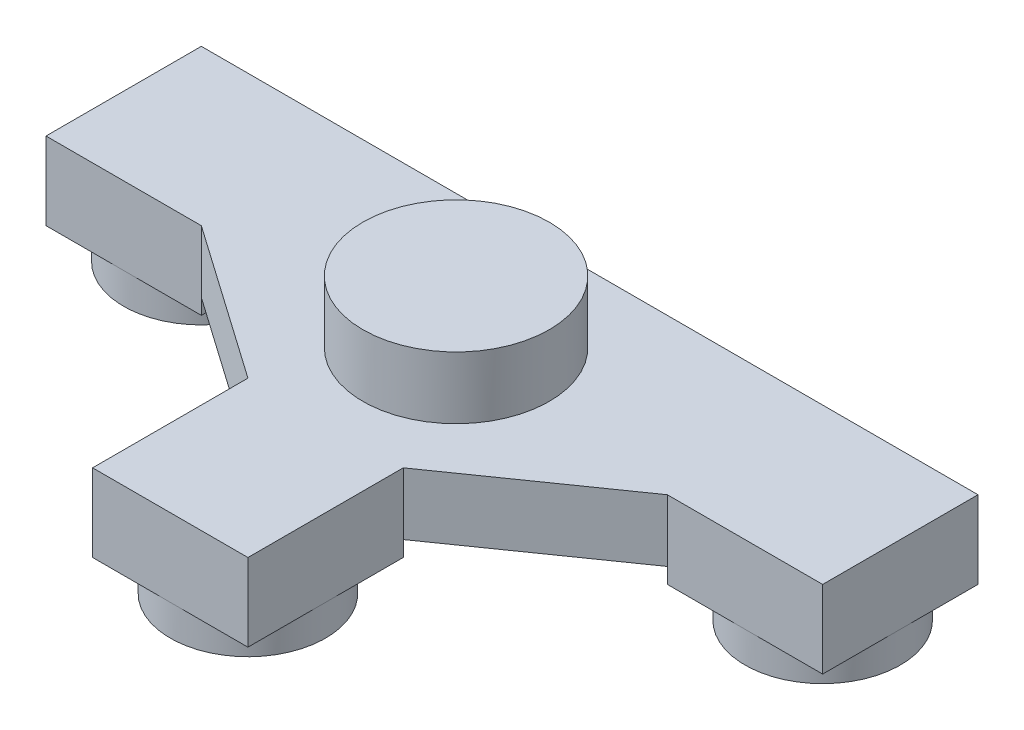
ISO-10303-21;
HEADER;
FILE_DESCRIPTION(('STEP AP214'),'2;1');
FILE_NAME('part.step','',(''),(''),'','','');
FILE_SCHEMA(('AUTOMOTIVE_DESIGN { 1 0 10303 214 1 1 1 1 }'));
ENDSEC;
DATA;
#1=APPLICATION_CONTEXT('core data for automotive mechanical design processes');
#2=APPLICATION_PROTOCOL_DEFINITION('international standard','automotive_design',2000,#1);
#3=PRODUCT_CONTEXT('',#1,'mechanical');
#4=PRODUCT('Part','Part','',(#3));
#5=PRODUCT_RELATED_PRODUCT_CATEGORY('part','',(#4));
#6=PRODUCT_DEFINITION_FORMATION('','',#4);
#7=PRODUCT_DEFINITION_CONTEXT('part definition',#1,'design');
#8=PRODUCT_DEFINITION('design','',#6,#7);
#9=PRODUCT_DEFINITION_SHAPE('','',#8);
#10=(LENGTH_UNIT() NAMED_UNIT(*) SI_UNIT(.MILLI.,.METRE.));
#11=(NAMED_UNIT(*) PLANE_ANGLE_UNIT() SI_UNIT($,.RADIAN.));
#12=(NAMED_UNIT(*) SI_UNIT($,.STERADIAN.) SOLID_ANGLE_UNIT());
#13=UNCERTAINTY_MEASURE_WITH_UNIT(LENGTH_MEASURE(1.E-05),#10,'distance_accuracy_value','');
#14=(GEOMETRIC_REPRESENTATION_CONTEXT(3) GLOBAL_UNCERTAINTY_ASSIGNED_CONTEXT((#13)) GLOBAL_UNIT_ASSIGNED_CONTEXT((#10,
#11,#12)) REPRESENTATION_CONTEXT('',''));
#15=CARTESIAN_POINT('',(0.,0.,0.));
#16=DIRECTION('',(0.,0.,1.));
#17=DIRECTION('',(1.,0.,0.));
#18=AXIS2_PLACEMENT_3D('',#15,#16,#17);
#19=CARTESIAN_POINT('',(0.,-1.,0.));
#20=DIRECTION('',(0.,1.,0.));
#21=DIRECTION('',(0.,0.,1.));
#22=AXIS2_PLACEMENT_3D('',#19,#20,#21);
#23=PLANE('',#22);
#24=CARTESIAN_POINT('',(-20.,-1.,0.));
#25=DIRECTION('',(0.,1.,0.));
#26=DIRECTION('',(0.,0.,1.));
#27=AXIS2_PLACEMENT_3D('',#24,#25,#26);
#28=CIRCLE('',#27,5.);
#29=CARTESIAN_POINT('',(-20.,-1.,5.));
#30=VERTEX_POINT('',#29);
#31=CARTESIAN_POINT('',(-25.,-1.,0.));
#32=VERTEX_POINT('',#31);
#33=EDGE_CURVE('E11',#30,#32,#28,.F.);
#34=ORIENTED_EDGE('',*,*,#33,.F.);
#35=DIRECTION('',(1.,0.,0.));
#36=VECTOR('',#35,1.);
#37=CARTESIAN_POINT('',(-25.,-1.,5.));
#38=LINE('',#37,#36);
#39=CARTESIAN_POINT('',(-25.,-1.,5.));
#40=VERTEX_POINT('',#39);
#41=EDGE_CURVE('E180',#40,#30,#38,.T.);
#42=ORIENTED_EDGE('',*,*,#41,.F.);
#43=DIRECTION('',(0.,0.,1.));
#44=VECTOR('',#43,1.);
#45=CARTESIAN_POINT('',(-25.,-1.,-5.));
#46=LINE('',#45,#44);
#47=EDGE_CURVE('E197',#32,#40,#46,.T.);
#48=ORIENTED_EDGE('',*,*,#47,.F.);
#49=EDGE_LOOP('',(#34,#42,#48));
#50=FACE_BOUND('',#49,.T.);
#51=ADVANCED_FACE('F39',(#50),#23,.F.);
#52=CARTESIAN_POINT('',(-20.,-1.,-5.));
#53=VERTEX_POINT('',#52);
#54=EDGE_CURVE('E49',#32,#53,#28,.F.);
#55=ORIENTED_EDGE('',*,*,#54,.F.);
#56=CARTESIAN_POINT('',(-25.,-1.,-5.));
#57=VERTEX_POINT('',#56);
#58=EDGE_CURVE('E196',#57,#32,#46,.T.);
#59=ORIENTED_EDGE('',*,*,#58,.F.);
#60=DIRECTION('',(-1.,0.,0.));
#61=VECTOR('',#60,1.);
#62=CARTESIAN_POINT('',(-25.,-1.,-5.));
#63=LINE('',#62,#61);
#64=EDGE_CURVE('E345',#53,#57,#63,.T.);
#65=ORIENTED_EDGE('',*,*,#64,.F.);
#66=EDGE_LOOP('',(#55,#59,#65));
#67=FACE_BOUND('',#66,.T.);
#68=ADVANCED_FACE('F430',(#67),#23,.F.);
#69=CARTESIAN_POINT('',(-20.,-1.,0.));
#70=DIRECTION('',(0.,-1.,0.));
#71=DIRECTION('',(0.,0.,-1.));
#72=AXIS2_PLACEMENT_3D('',#69,#70,#71);
#73=CIRCLE('',#72,5.);
#74=CARTESIAN_POINT('',(-15.,-1.,0.));
#75=VERTEX_POINT('',#74);
#76=EDGE_CURVE('E62',#53,#75,#73,.T.);
#77=ORIENTED_EDGE('',*,*,#76,.F.);
#78=CARTESIAN_POINT('',(-15.,-1.,-5.));
#79=VERTEX_POINT('',#78);
#80=EDGE_CURVE('E333',#79,#53,#63,.T.);
#81=ORIENTED_EDGE('',*,*,#80,.F.);
#82=DIRECTION('',(0.,0.,-1.));
#83=VECTOR('',#82,1.);
#84=CARTESIAN_POINT('',(-15.,-1.,-5.));
#85=LINE('',#84,#83);
#86=EDGE_CURVE('E190',#75,#79,#85,.T.);
#87=ORIENTED_EDGE('',*,*,#86,.F.);
#88=EDGE_LOOP('',(#77,#81,#87));
#89=FACE_BOUND('',#88,.T.);
#90=ADVANCED_FACE('F435',(#89),#23,.F.);
#91=CARTESIAN_POINT('',(0.,-1.,0.));
#92=DIRECTION('',(0.,1.,0.));
#93=DIRECTION('',(0.,0.,1.));
#94=AXIS2_PLACEMENT_3D('',#91,#92,#93);
#95=PLANE('',#94);
#96=CARTESIAN_POINT('',(20.,-1.,0.));
#97=DIRECTION('',(0.,1.,0.));
#98=DIRECTION('',(0.,0.,1.));
#99=AXIS2_PLACEMENT_3D('',#96,#97,#98);
#100=CIRCLE('',#99,5.);
#101=CARTESIAN_POINT('',(20.,-1.,5.));
#102=VERTEX_POINT('',#101);
#103=CARTESIAN_POINT('',(15.,-1.,0.));
#104=VERTEX_POINT('',#103);
#105=EDGE_CURVE('E203',#102,#104,#100,.F.);
#106=ORIENTED_EDGE('',*,*,#105,.F.);
#107=DIRECTION('',(1.,0.,0.));
#108=VECTOR('',#107,1.);
#109=CARTESIAN_POINT('',(15.,-1.,5.));
#110=LINE('',#109,#108);
#111=CARTESIAN_POINT('',(15.,-1.,5.));
#112=VERTEX_POINT('',#111);
#113=EDGE_CURVE('E372',#112,#102,#110,.T.);
#114=ORIENTED_EDGE('',*,*,#113,.F.);
#115=DIRECTION('',(0.,0.,1.));
#116=VECTOR('',#115,1.);
#117=CARTESIAN_POINT('',(15.,-1.,-5.));
#118=LINE('',#117,#116);
#119=EDGE_CURVE('E361',#104,#112,#118,.T.);
#120=ORIENTED_EDGE('',*,*,#119,.F.);
#121=EDGE_LOOP('',(#106,#114,#120));
#122=FACE_BOUND('',#121,.T.);
#123=ADVANCED_FACE('F451',(#122),#95,.F.);
#124=CARTESIAN_POINT('',(20.,-1.,-5.));
#125=VERTEX_POINT('',#124);
#126=EDGE_CURVE('E207',#104,#125,#100,.F.);
#127=ORIENTED_EDGE('',*,*,#126,.F.);
#128=CARTESIAN_POINT('',(15.,-1.,-5.));
#129=VERTEX_POINT('',#128);
#130=EDGE_CURVE('E376',#129,#104,#118,.T.);
#131=ORIENTED_EDGE('',*,*,#130,.F.);
#132=DIRECTION('',(-1.,0.,0.));
#133=VECTOR('',#132,1.);
#134=CARTESIAN_POINT('',(15.,-1.,-5.));
#135=LINE('',#134,#133);
#136=EDGE_CURVE('E366',#125,#129,#135,.T.);
#137=ORIENTED_EDGE('',*,*,#136,.F.);
#138=EDGE_LOOP('',(#127,#131,#137));
#139=FACE_BOUND('',#138,.T.);
#140=ADVANCED_FACE('F455',(#139),#95,.F.);
#141=CARTESIAN_POINT('',(20.,-1.,0.));
#142=DIRECTION('',(0.,-1.,0.));
#143=DIRECTION('',(0.,0.,-1.));
#144=AXIS2_PLACEMENT_3D('',#141,#142,#143);
#145=CIRCLE('',#144,5.);
#146=CARTESIAN_POINT('',(25.,-1.,0.));
#147=VERTEX_POINT('',#146);
#148=EDGE_CURVE('E240',#125,#147,#145,.T.);
#149=ORIENTED_EDGE('',*,*,#148,.F.);
#150=CARTESIAN_POINT('',(25.,-1.,-5.));
#151=VERTEX_POINT('',#150);
#152=EDGE_CURVE('E353',#151,#125,#135,.T.);
#153=ORIENTED_EDGE('',*,*,#152,.F.);
#154=DIRECTION('',(0.,0.,-1.));
#155=VECTOR('',#154,1.);
#156=CARTESIAN_POINT('',(25.,-1.,-5.));
#157=LINE('',#156,#155);
#158=EDGE_CURVE('E371',#147,#151,#157,.T.);
#159=ORIENTED_EDGE('',*,*,#158,.F.);
#160=EDGE_LOOP('',(#149,#153,#159));
#161=FACE_BOUND('',#160,.T.);
#162=ADVANCED_FACE('F461',(#161),#95,.F.);
#163=CARTESIAN_POINT('',(0.,-1.,0.));
#164=DIRECTION('',(0.,1.,0.));
#165=DIRECTION('',(0.,0.,1.));
#166=AXIS2_PLACEMENT_3D('',#163,#164,#165);
#167=PLANE('',#166);
#168=CARTESIAN_POINT('',(0.,-1.,17.));
#169=DIRECTION('',(0.,-1.,0.));
#170=DIRECTION('',(0.,0.,-1.));
#171=AXIS2_PLACEMENT_3D('',#168,#169,#170);
#172=CIRCLE('',#171,5.);
#173=CARTESIAN_POINT('',(0.,-1.,12.));
#174=VERTEX_POINT('',#173);
#175=CARTESIAN_POINT('',(5.,-1.,17.));
#176=VERTEX_POINT('',#175);
#177=EDGE_CURVE('E222',#174,#176,#172,.T.);
#178=ORIENTED_EDGE('',*,*,#177,.F.);
#179=DIRECTION('',(-1.,0.,0.));
#180=VECTOR('',#179,1.);
#181=CARTESIAN_POINT('',(-5.,-1.,12.));
#182=LINE('',#181,#180);
#183=CARTESIAN_POINT('',(5.,-1.,12.));
#184=VERTEX_POINT('',#183);
#185=EDGE_CURVE('E384',#184,#174,#182,.T.);
#186=ORIENTED_EDGE('',*,*,#185,.F.);
#187=DIRECTION('',(0.,0.,-1.));
#188=VECTOR('',#187,1.);
#189=CARTESIAN_POINT('',(5.,-1.,12.));
#190=LINE('',#189,#188);
#191=EDGE_CURVE('E399',#176,#184,#190,.T.);
#192=ORIENTED_EDGE('',*,*,#191,.F.);
#193=EDGE_LOOP('',(#178,#186,#192));
#194=FACE_BOUND('',#193,.T.);
#195=ADVANCED_FACE('F427',(#194),#167,.F.);
#196=CARTESIAN_POINT('',(0.,-1.,22.));
#197=VERTEX_POINT('',#196);
#198=EDGE_CURVE('E216',#176,#197,#172,.T.);
#199=ORIENTED_EDGE('',*,*,#198,.F.);
#200=CARTESIAN_POINT('',(5.,-1.,22.));
#201=VERTEX_POINT('',#200);
#202=EDGE_CURVE('E395',#201,#176,#190,.T.);
#203=ORIENTED_EDGE('',*,*,#202,.F.);
#204=DIRECTION('',(1.,0.,0.));
#205=VECTOR('',#204,1.);
#206=CARTESIAN_POINT('',(-5.,-1.,22.));
#207=LINE('',#206,#205);
#208=EDGE_CURVE('E404',#197,#201,#207,.T.);
#209=ORIENTED_EDGE('',*,*,#208,.F.);
#210=EDGE_LOOP('',(#199,#203,#209));
#211=FACE_BOUND('',#210,.T.);
#212=ADVANCED_FACE('F475',(#211),#167,.F.);
#213=CARTESIAN_POINT('',(-5.,-1.,17.));
#214=VERTEX_POINT('',#213);
#215=EDGE_CURVE('E220',#197,#214,#172,.T.);
#216=ORIENTED_EDGE('',*,*,#215,.F.);
#217=CARTESIAN_POINT('',(-5.,-1.,22.));
#218=VERTEX_POINT('',#217);
#219=EDGE_CURVE('E400',#218,#197,#207,.T.);
#220=ORIENTED_EDGE('',*,*,#219,.F.);
#221=DIRECTION('',(0.,0.,1.));
#222=VECTOR('',#221,1.);
#223=CARTESIAN_POINT('',(-5.,-1.,12.));
#224=LINE('',#223,#222);
#225=EDGE_CURVE('E391',#214,#218,#224,.T.);
#226=ORIENTED_EDGE('',*,*,#225,.F.);
#227=EDGE_LOOP('',(#216,#220,#226));
#228=FACE_BOUND('',#227,.T.);
#229=ADVANCED_FACE('F428',(#228),#167,.F.);
#230=CARTESIAN_POINT('',(0.,0.,0.));
#231=DIRECTION('',(0.,-1.,0.));
#232=DIRECTION('',(0.,0.,-1.));
#233=AXIS2_PLACEMENT_3D('',#230,#231,#232);
#234=PLANE('',#233);
#235=DIRECTION('',(-1.,0.,0.));
#236=VECTOR('',#235,1.);
#237=CARTESIAN_POINT('',(-5.,0.,12.));
#238=LINE('',#237,#236);
#239=CARTESIAN_POINT('',(5.,0.,12.));
#240=VERTEX_POINT('',#239);
#241=CARTESIAN_POINT('',(-5.,0.,12.));
#242=VERTEX_POINT('',#241);
#243=EDGE_CURVE('E387',#240,#242,#238,.T.);
#244=ORIENTED_EDGE('',*,*,#243,.T.);
#245=DIRECTION('',(0.81923192051904,0.,0.573462344363328));
#246=VECTOR('',#245,1.);
#247=CARTESIAN_POINT('',(-15.,0.,5.));
#248=LINE('',#247,#246);
#249=CARTESIAN_POINT('',(-15.,0.,5.));
#250=VERTEX_POINT('',#249);
#251=EDGE_CURVE('E296',#250,#242,#248,.T.);
#252=ORIENTED_EDGE('',*,*,#251,.F.);
#253=DIRECTION('',(0.,0.,-1.));
#254=VECTOR('',#253,1.);
#255=CARTESIAN_POINT('',(-15.,0.,-5.));
#256=LINE('',#255,#254);
#257=CARTESIAN_POINT('',(-15.,0.,-5.));
#258=VERTEX_POINT('',#257);
#259=EDGE_CURVE('E337',#250,#258,#256,.T.);
#260=ORIENTED_EDGE('',*,*,#259,.T.);
#261=DIRECTION('',(-1.,0.,0.));
#262=VECTOR('',#261,1.);
#263=CARTESIAN_POINT('',(25.,0.,-5.));
#264=LINE('',#263,#262);
#265=CARTESIAN_POINT('',(15.,0.,-5.));
#266=VERTEX_POINT('',#265);
#267=EDGE_CURVE('E288',#266,#258,#264,.T.);
#268=ORIENTED_EDGE('',*,*,#267,.F.);
#269=DIRECTION('',(0.,0.,1.));
#270=VECTOR('',#269,1.);
#271=CARTESIAN_POINT('',(15.,0.,-5.));
#272=LINE('',#271,#270);
#273=CARTESIAN_POINT('',(15.,0.,5.));
#274=VERTEX_POINT('',#273);
#275=EDGE_CURVE('E357',#266,#274,#272,.T.);
#276=ORIENTED_EDGE('',*,*,#275,.T.);
#277=DIRECTION('',(0.81923192051904,0.,-0.573462344363329));
#278=VECTOR('',#277,1.);
#279=CARTESIAN_POINT('',(5.,0.,12.));
#280=LINE('',#279,#278);
#281=EDGE_CURVE('E292',#240,#274,#280,.T.);
#282=ORIENTED_EDGE('',*,*,#281,.F.);
#283=EDGE_LOOP('',(#244,#252,#260,#268,#276,#282));
#284=FACE_BOUND('',#283,.T.);
#285=ADVANCED_FACE('F604',(#284),#234,.T.);
#286=CARTESIAN_POINT('',(-25.,4.,5.));
#287=DIRECTION('',(0.,0.,-1.));
#288=DIRECTION('',(-1.,0.,0.));
#289=AXIS2_PLACEMENT_3D('',#286,#287,#288);
#290=PLANE('',#289);
#291=DIRECTION('',(0.,-1.,0.));
#292=VECTOR('',#291,1.);
#293=CARTESIAN_POINT('',(-25.,4.,5.));
#294=LINE('',#293,#292);
#295=CARTESIAN_POINT('',(-25.,4.,5.));
#296=VERTEX_POINT('',#295);
#297=EDGE_CURVE('E185',#296,#40,#294,.T.);
#298=ORIENTED_EDGE('',*,*,#297,.T.);
#299=ORIENTED_EDGE('',*,*,#41,.T.);
#300=CARTESIAN_POINT('',(-15.,-1.,5.));
#301=VERTEX_POINT('',#300);
#302=EDGE_CURVE('E181',#30,#301,#38,.T.);
#303=ORIENTED_EDGE('',*,*,#302,.T.);
#304=DIRECTION('',(0.,1.,0.));
#305=VECTOR('',#304,1.);
#306=CARTESIAN_POINT('',(-15.,-1.,5.));
#307=LINE('',#306,#305);
#308=EDGE_CURVE('E330',#301,#250,#307,.T.);
#309=ORIENTED_EDGE('',*,*,#308,.T.);
#310=DIRECTION('',(0.,-1.,0.));
#311=VECTOR('',#310,1.);
#312=CARTESIAN_POINT('',(-15.,4.,5.));
#313=LINE('',#312,#311);
#314=CARTESIAN_POINT('',(-15.,4.,5.));
#315=VERTEX_POINT('',#314);
#316=EDGE_CURVE('E246',#315,#250,#313,.T.);
#317=ORIENTED_EDGE('',*,*,#316,.F.);
#318=DIRECTION('',(1.,0.,0.));
#319=VECTOR('',#318,1.);
#320=CARTESIAN_POINT('',(-25.,4.,5.));
#321=LINE('',#320,#319);
#322=EDGE_CURVE('E291',#296,#315,#321,.T.);
#323=ORIENTED_EDGE('',*,*,#322,.F.);
#324=EDGE_LOOP('',(#298,#299,#303,#309,#317,#323));
#325=FACE_BOUND('',#324,.T.);
#326=ADVANCED_FACE('F41',(#325),#290,.F.);
#327=CARTESIAN_POINT('',(-15.,4.,5.));
#328=DIRECTION('',(0.573462344363329,0.,-0.81923192051904));
#329=DIRECTION('',(-0.81923192051904,0.,-0.573462344363329));
#330=AXIS2_PLACEMENT_3D('',#327,#328,#329);
#331=PLANE('',#330);
#332=ORIENTED_EDGE('',*,*,#251,.T.);
#333=DIRECTION('',(0.,-1.,0.));
#334=VECTOR('',#333,1.);
#335=CARTESIAN_POINT('',(-5.,4.,12.));
#336=LINE('',#335,#334);
#337=CARTESIAN_POINT('',(-5.,4.,12.));
#338=VERTEX_POINT('',#337);
#339=EDGE_CURVE('E251',#338,#242,#336,.T.);
#340=ORIENTED_EDGE('',*,*,#339,.F.);
#341=DIRECTION('',(0.81923192051904,0.,0.573462344363328));
#342=VECTOR('',#341,1.);
#343=CARTESIAN_POINT('',(-15.,4.,5.));
#344=LINE('',#343,#342);
#345=EDGE_CURVE('E324',#315,#338,#344,.T.);
#346=ORIENTED_EDGE('',*,*,#345,.F.);
#347=ORIENTED_EDGE('',*,*,#316,.T.);
#348=EDGE_LOOP('',(#332,#340,#346,#347));
#349=FACE_BOUND('',#348,.T.);
#350=ADVANCED_FACE('F719',(#349),#331,.F.);
#351=CARTESIAN_POINT('',(-5.,4.,12.));
#352=DIRECTION('',(1.,0.,0.));
#353=DIRECTION('',(0.,0.,-1.));
#354=AXIS2_PLACEMENT_3D('',#351,#352,#353);
#355=PLANE('',#354);
#356=ORIENTED_EDGE('',*,*,#339,.T.);
#357=DIRECTION('',(0.,1.,0.));
#358=VECTOR('',#357,1.);
#359=CARTESIAN_POINT('',(-5.,-1.,12.));
#360=LINE('',#359,#358);
#361=CARTESIAN_POINT('',(-5.,-1.,12.));
#362=VERTEX_POINT('',#361);
#363=EDGE_CURVE('E362',#362,#242,#360,.T.);
#364=ORIENTED_EDGE('',*,*,#363,.F.);
#365=EDGE_CURVE('E405',#362,#214,#224,.T.);
#366=ORIENTED_EDGE('',*,*,#365,.T.);
#367=ORIENTED_EDGE('',*,*,#225,.T.);
#368=DIRECTION('',(0.,-1.,0.));
#369=VECTOR('',#368,1.);
#370=CARTESIAN_POINT('',(-5.,4.,22.));
#371=LINE('',#370,#369);
#372=CARTESIAN_POINT('',(-5.,4.,22.));
#373=VERTEX_POINT('',#372);
#374=EDGE_CURVE('E257',#373,#218,#371,.T.);
#375=ORIENTED_EDGE('',*,*,#374,.F.);
#376=DIRECTION('',(0.,0.,1.));
#377=VECTOR('',#376,1.);
#378=CARTESIAN_POINT('',(-5.,4.,12.));
#379=LINE('',#378,#377);
#380=EDGE_CURVE('E321',#338,#373,#379,.T.);
#381=ORIENTED_EDGE('',*,*,#380,.F.);
#382=EDGE_LOOP('',(#356,#364,#366,#367,#375,#381));
#383=FACE_BOUND('',#382,.T.);
#384=ADVANCED_FACE('F709',(#383),#355,.F.);
#385=CARTESIAN_POINT('',(-5.,4.,22.));
#386=DIRECTION('',(0.,0.,-1.));
#387=DIRECTION('',(-1.,0.,0.));
#388=AXIS2_PLACEMENT_3D('',#385,#386,#387);
#389=PLANE('',#388);
#390=ORIENTED_EDGE('',*,*,#374,.T.);
#391=ORIENTED_EDGE('',*,*,#219,.T.);
#392=ORIENTED_EDGE('',*,*,#208,.T.);
#393=DIRECTION('',(0.,-1.,0.));
#394=VECTOR('',#393,1.);
#395=CARTESIAN_POINT('',(5.,4.,22.));
#396=LINE('',#395,#394);
#397=CARTESIAN_POINT('',(5.,4.,22.));
#398=VERTEX_POINT('',#397);
#399=EDGE_CURVE('E261',#398,#201,#396,.T.);
#400=ORIENTED_EDGE('',*,*,#399,.F.);
#401=DIRECTION('',(1.,0.,0.));
#402=VECTOR('',#401,1.);
#403=CARTESIAN_POINT('',(-5.,4.,22.));
#404=LINE('',#403,#402);
#405=EDGE_CURVE('E318',#373,#398,#404,.T.);
#406=ORIENTED_EDGE('',*,*,#405,.F.);
#407=EDGE_LOOP('',(#390,#391,#392,#400,#406));
#408=FACE_BOUND('',#407,.T.);
#409=ADVANCED_FACE('F698',(#408),#389,.F.);
#410=CARTESIAN_POINT('',(5.,4.,22.));
#411=DIRECTION('',(-1.,0.,0.));
#412=DIRECTION('',(0.,0.,1.));
#413=AXIS2_PLACEMENT_3D('',#410,#411,#412);
#414=PLANE('',#413);
#415=ORIENTED_EDGE('',*,*,#399,.T.);
#416=ORIENTED_EDGE('',*,*,#202,.T.);
#417=ORIENTED_EDGE('',*,*,#191,.T.);
#418=DIRECTION('',(0.,1.,0.));
#419=VECTOR('',#418,1.);
#420=CARTESIAN_POINT('',(5.,-1.,12.));
#421=LINE('',#420,#419);
#422=EDGE_CURVE('E380',#184,#240,#421,.T.);
#423=ORIENTED_EDGE('',*,*,#422,.T.);
#424=DIRECTION('',(0.,-1.,0.));
#425=VECTOR('',#424,1.);
#426=CARTESIAN_POINT('',(5.,4.,12.));
#427=LINE('',#426,#425);
#428=CARTESIAN_POINT('',(5.,4.,12.));
#429=VERTEX_POINT('',#428);
#430=EDGE_CURVE('E265',#429,#240,#427,.T.);
#431=ORIENTED_EDGE('',*,*,#430,.F.);
#432=DIRECTION('',(0.,0.,-1.));
#433=VECTOR('',#432,1.);
#434=CARTESIAN_POINT('',(5.,4.,22.));
#435=LINE('',#434,#433);
#436=EDGE_CURVE('E315',#398,#429,#435,.T.);
#437=ORIENTED_EDGE('',*,*,#436,.F.);
#438=EDGE_LOOP('',(#415,#416,#417,#423,#431,#437));
#439=FACE_BOUND('',#438,.T.);
#440=ADVANCED_FACE('F694',(#439),#414,.F.);
#441=CARTESIAN_POINT('',(5.,4.,12.));
#442=DIRECTION('',(-0.573462344363329,0.,-0.81923192051904));
#443=DIRECTION('',(-0.81923192051904,0.,0.573462344363329));
#444=AXIS2_PLACEMENT_3D('',#441,#442,#443);
#445=PLANE('',#444);
#446=ORIENTED_EDGE('',*,*,#281,.T.);
#447=DIRECTION('',(0.,-1.,0.));
#448=VECTOR('',#447,1.);
#449=CARTESIAN_POINT('',(15.,4.,5.));
#450=LINE('',#449,#448);
#451=CARTESIAN_POINT('',(15.,4.,5.));
#452=VERTEX_POINT('',#451);
#453=EDGE_CURVE('E269',#452,#274,#450,.T.);
#454=ORIENTED_EDGE('',*,*,#453,.F.);
#455=DIRECTION('',(0.81923192051904,0.,-0.573462344363329));
#456=VECTOR('',#455,1.);
#457=CARTESIAN_POINT('',(5.,4.,12.));
#458=LINE('',#457,#456);
#459=EDGE_CURVE('E312',#429,#452,#458,.T.);
#460=ORIENTED_EDGE('',*,*,#459,.F.);
#461=ORIENTED_EDGE('',*,*,#430,.T.);
#462=EDGE_LOOP('',(#446,#454,#460,#461));
#463=FACE_BOUND('',#462,.T.);
#464=ADVANCED_FACE('F685',(#463),#445,.F.);
#465=CARTESIAN_POINT('',(15.,4.,5.));
#466=DIRECTION('',(0.,0.,-1.));
#467=DIRECTION('',(-1.,0.,0.));
#468=AXIS2_PLACEMENT_3D('',#465,#466,#467);
#469=PLANE('',#468);
#470=ORIENTED_EDGE('',*,*,#453,.T.);
#471=DIRECTION('',(0.,1.,0.));
#472=VECTOR('',#471,1.);
#473=CARTESIAN_POINT('',(15.,-1.,5.));
#474=LINE('',#473,#472);
#475=EDGE_CURVE('E350',#112,#274,#474,.T.);
#476=ORIENTED_EDGE('',*,*,#475,.F.);
#477=ORIENTED_EDGE('',*,*,#113,.T.);
#478=CARTESIAN_POINT('',(25.,-1.,5.));
#479=VERTEX_POINT('',#478);
#480=EDGE_CURVE('E375',#102,#479,#110,.T.);
#481=ORIENTED_EDGE('',*,*,#480,.T.);
#482=DIRECTION('',(0.,-1.,0.));
#483=VECTOR('',#482,1.);
#484=CARTESIAN_POINT('',(25.,4.,5.));
#485=LINE('',#484,#483);
#486=CARTESIAN_POINT('',(25.,4.,5.));
#487=VERTEX_POINT('',#486);
#488=EDGE_CURVE('E273',#487,#479,#485,.T.);
#489=ORIENTED_EDGE('',*,*,#488,.F.);
#490=DIRECTION('',(1.,0.,0.));
#491=VECTOR('',#490,1.);
#492=CARTESIAN_POINT('',(15.,4.,5.));
#493=LINE('',#492,#491);
#494=EDGE_CURVE('E309',#452,#487,#493,.T.);
#495=ORIENTED_EDGE('',*,*,#494,.F.);
#496=EDGE_LOOP('',(#470,#476,#477,#481,#489,#495));
#497=FACE_BOUND('',#496,.T.);
#498=ADVANCED_FACE('F674',(#497),#469,.F.);
#499=CARTESIAN_POINT('',(25.,4.,5.));
#500=DIRECTION('',(-1.,0.,0.));
#501=DIRECTION('',(0.,0.,1.));
#502=AXIS2_PLACEMENT_3D('',#499,#500,#501);
#503=PLANE('',#502);
#504=ORIENTED_EDGE('',*,*,#488,.T.);
#505=EDGE_CURVE('E367',#479,#147,#157,.T.);
#506=ORIENTED_EDGE('',*,*,#505,.T.);
#507=ORIENTED_EDGE('',*,*,#158,.T.);
#508=DIRECTION('',(0.,-1.,0.));
#509=VECTOR('',#508,1.);
#510=CARTESIAN_POINT('',(25.,4.,-5.));
#511=LINE('',#510,#509);
#512=CARTESIAN_POINT('',(25.,4.,-5.));
#513=VERTEX_POINT('',#512);
#514=EDGE_CURVE('E277',#513,#151,#511,.T.);
#515=ORIENTED_EDGE('',*,*,#514,.F.);
#516=DIRECTION('',(0.,0.,-1.));
#517=VECTOR('',#516,1.);
#518=CARTESIAN_POINT('',(25.,4.,5.));
#519=LINE('',#518,#517);
#520=EDGE_CURVE('E306',#487,#513,#519,.T.);
#521=ORIENTED_EDGE('',*,*,#520,.F.);
#522=EDGE_LOOP('',(#504,#506,#507,#515,#521));
#523=FACE_BOUND('',#522,.T.);
#524=ADVANCED_FACE('F663',(#523),#503,.F.);
#525=CARTESIAN_POINT('',(25.,4.,-5.));
#526=DIRECTION('',(0.,0.,1.));
#527=DIRECTION('',(1.,0.,0.));
#528=AXIS2_PLACEMENT_3D('',#525,#526,#527);
#529=PLANE('',#528);
#530=ORIENTED_EDGE('',*,*,#514,.T.);
#531=ORIENTED_EDGE('',*,*,#152,.T.);
#532=ORIENTED_EDGE('',*,*,#136,.T.);
#533=DIRECTION('',(0.,1.,0.));
#534=VECTOR('',#533,1.);
#535=CARTESIAN_POINT('',(15.,-1.,-5.));
#536=LINE('',#535,#534);
#537=EDGE_CURVE('E341',#129,#266,#536,.T.);
#538=ORIENTED_EDGE('',*,*,#537,.T.);
#539=ORIENTED_EDGE('',*,*,#267,.T.);
#540=DIRECTION('',(0.,1.,0.));
#541=VECTOR('',#540,1.);
#542=CARTESIAN_POINT('',(-15.,-1.,-5.));
#543=LINE('',#542,#541);
#544=EDGE_CURVE('E300',#79,#258,#543,.T.);
#545=ORIENTED_EDGE('',*,*,#544,.F.);
#546=ORIENTED_EDGE('',*,*,#80,.T.);
#547=ORIENTED_EDGE('',*,*,#64,.T.);
#548=DIRECTION('',(0.,-1.,0.));
#549=VECTOR('',#548,1.);
#550=CARTESIAN_POINT('',(-25.,4.,-5.));
#551=LINE('',#550,#549);
#552=CARTESIAN_POINT('',(-25.,4.,-5.));
#553=VERTEX_POINT('',#552);
#554=EDGE_CURVE('E281',#553,#57,#551,.T.);
#555=ORIENTED_EDGE('',*,*,#554,.F.);
#556=DIRECTION('',(-1.,0.,0.));
#557=VECTOR('',#556,1.);
#558=CARTESIAN_POINT('',(25.,4.,-5.));
#559=LINE('',#558,#557);
#560=EDGE_CURVE('E303',#513,#553,#559,.T.);
#561=ORIENTED_EDGE('',*,*,#560,.F.);
#562=EDGE_LOOP('',(#530,#531,#532,#538,#539,#545,#546,#547,#555,#561));
#563=FACE_BOUND('',#562,.T.);
#564=ADVANCED_FACE('F488',(#563),#529,.F.);
#565=CARTESIAN_POINT('',(-25.,4.,-5.));
#566=DIRECTION('',(1.,0.,0.));
#567=DIRECTION('',(0.,0.,-1.));
#568=AXIS2_PLACEMENT_3D('',#565,#566,#567);
#569=PLANE('',#568);
#570=ORIENTED_EDGE('',*,*,#554,.T.);
#571=ORIENTED_EDGE('',*,*,#58,.T.);
#572=ORIENTED_EDGE('',*,*,#47,.T.);
#573=ORIENTED_EDGE('',*,*,#297,.F.);
#574=DIRECTION('',(0.,0.,1.));
#575=VECTOR('',#574,1.);
#576=CARTESIAN_POINT('',(-25.,4.,-5.));
#577=LINE('',#576,#575);
#578=EDGE_CURVE('E287',#553,#296,#577,.T.);
#579=ORIENTED_EDGE('',*,*,#578,.F.);
#580=EDGE_LOOP('',(#570,#571,#572,#573,#579));
#581=FACE_BOUND('',#580,.T.);
#582=ADVANCED_FACE('F645',(#581),#569,.F.);
#583=CARTESIAN_POINT('',(0.,4.,0.));
#584=DIRECTION('',(0.,-1.,0.));
#585=DIRECTION('',(0.,0.,-1.));
#586=AXIS2_PLACEMENT_3D('',#583,#584,#585);
#587=PLANE('',#586);
#588=CARTESIAN_POINT('',(0.,4.,3.6));
#589=DIRECTION('',(0.,-1.,0.));
#590=DIRECTION('',(0.,0.,-1.));
#591=AXIS2_PLACEMENT_3D('',#588,#589,#590);
#592=CIRCLE('',#591,6.);
#593=CARTESIAN_POINT('',(0.,4.,-2.4));
#594=VERTEX_POINT('',#593);
#595=EDGE_CURVE('E243',#594,#594,#592,.F.);
#596=ORIENTED_EDGE('',*,*,#595,.F.);
#597=EDGE_LOOP('',(#596));
#598=FACE_BOUND('',#597,.T.);
#599=ORIENTED_EDGE('',*,*,#322,.T.);
#600=ORIENTED_EDGE('',*,*,#345,.T.);
#601=ORIENTED_EDGE('',*,*,#380,.T.);
#602=ORIENTED_EDGE('',*,*,#405,.T.);
#603=ORIENTED_EDGE('',*,*,#436,.T.);
#604=ORIENTED_EDGE('',*,*,#459,.T.);
#605=ORIENTED_EDGE('',*,*,#494,.T.);
#606=ORIENTED_EDGE('',*,*,#520,.T.);
#607=ORIENTED_EDGE('',*,*,#560,.T.);
#608=ORIENTED_EDGE('',*,*,#578,.T.);
#609=EDGE_LOOP('',(#599,#600,#601,#602,#603,#604,#605,#606,#607,#608));
#610=FACE_BOUND('',#609,.T.);
#611=ADVANCED_FACE('F448',(#598,#610),#587,.F.);
#612=CARTESIAN_POINT('',(-15.,-1.,-5.));
#613=DIRECTION('',(1.,0.,0.));
#614=DIRECTION('',(0.,0.,-1.));
#615=AXIS2_PLACEMENT_3D('',#612,#613,#614);
#616=PLANE('',#615);
#617=ORIENTED_EDGE('',*,*,#259,.F.);
#618=ORIENTED_EDGE('',*,*,#308,.F.);
#619=EDGE_CURVE('E194',#301,#75,#85,.T.);
#620=ORIENTED_EDGE('',*,*,#619,.T.);
#621=ORIENTED_EDGE('',*,*,#86,.T.);
#622=ORIENTED_EDGE('',*,*,#544,.T.);
#623=EDGE_LOOP('',(#617,#618,#620,#621,#622));
#624=FACE_BOUND('',#623,.T.);
#625=ADVANCED_FACE('F441',(#624),#616,.T.);
#626=EDGE_CURVE('E43',#75,#30,#28,.F.);
#627=ORIENTED_EDGE('',*,*,#626,.F.);
#628=ORIENTED_EDGE('',*,*,#619,.F.);
#629=ORIENTED_EDGE('',*,*,#302,.F.);
#630=EDGE_LOOP('',(#627,#628,#629));
#631=FACE_BOUND('',#630,.T.);
#632=ADVANCED_FACE('F192',(#631),#23,.F.);
#633=CARTESIAN_POINT('',(15.,-1.,-5.));
#634=DIRECTION('',(-1.,0.,0.));
#635=DIRECTION('',(0.,0.,1.));
#636=AXIS2_PLACEMENT_3D('',#633,#634,#635);
#637=PLANE('',#636);
#638=ORIENTED_EDGE('',*,*,#275,.F.);
#639=ORIENTED_EDGE('',*,*,#537,.F.);
#640=ORIENTED_EDGE('',*,*,#130,.T.);
#641=ORIENTED_EDGE('',*,*,#119,.T.);
#642=ORIENTED_EDGE('',*,*,#475,.T.);
#643=EDGE_LOOP('',(#638,#639,#640,#641,#642));
#644=FACE_BOUND('',#643,.T.);
#645=ADVANCED_FACE('F440',(#644),#637,.T.);
#646=EDGE_CURVE('E208',#147,#102,#100,.F.);
#647=ORIENTED_EDGE('',*,*,#646,.F.);
#648=ORIENTED_EDGE('',*,*,#505,.F.);
#649=ORIENTED_EDGE('',*,*,#480,.F.);
#650=EDGE_LOOP('',(#647,#648,#649));
#651=FACE_BOUND('',#650,.T.);
#652=ADVANCED_FACE('F446',(#651),#95,.F.);
#653=CARTESIAN_POINT('',(-5.,-1.,12.));
#654=DIRECTION('',(0.,0.,-1.));
#655=DIRECTION('',(-1.,0.,0.));
#656=AXIS2_PLACEMENT_3D('',#653,#654,#655);
#657=PLANE('',#656);
#658=ORIENTED_EDGE('',*,*,#243,.F.);
#659=ORIENTED_EDGE('',*,*,#422,.F.);
#660=ORIENTED_EDGE('',*,*,#185,.T.);
#661=EDGE_CURVE('E394',#174,#362,#182,.T.);
#662=ORIENTED_EDGE('',*,*,#661,.T.);
#663=ORIENTED_EDGE('',*,*,#363,.T.);
#664=EDGE_LOOP('',(#658,#659,#660,#662,#663));
#665=FACE_BOUND('',#664,.T.);
#666=ADVANCED_FACE('F424',(#665),#657,.T.);
#667=EDGE_CURVE('E227',#214,#174,#172,.T.);
#668=ORIENTED_EDGE('',*,*,#667,.F.);
#669=ORIENTED_EDGE('',*,*,#365,.F.);
#670=ORIENTED_EDGE('',*,*,#661,.F.);
#671=EDGE_LOOP('',(#668,#669,#670));
#672=FACE_BOUND('',#671,.T.);
#673=ADVANCED_FACE('F416',(#672),#167,.F.);
#674=CARTESIAN_POINT('',(0.,8.,3.6));
#675=DIRECTION('',(0.,-1.,0.));
#676=DIRECTION('',(0.,0.,-1.));
#677=AXIS2_PLACEMENT_3D('',#674,#675,#676);
#678=CYLINDRICAL_SURFACE('',#677,6.);
#679=CARTESIAN_POINT('',(0.,8.,3.6));
#680=DIRECTION('',(0.,1.,0.));
#681=DIRECTION('',(0.,0.,1.));
#682=AXIS2_PLACEMENT_3D('',#679,#680,#681);
#683=CIRCLE('',#682,6.);
#684=CARTESIAN_POINT('',(0.,8.,9.6));
#685=VERTEX_POINT('',#684);
#686=EDGE_CURVE('E238',#685,#685,#683,.T.);
#687=ORIENTED_EDGE('',*,*,#686,.F.);
#688=EDGE_LOOP('',(#687));
#689=FACE_BOUND('',#688,.T.);
#690=ORIENTED_EDGE('',*,*,#595,.T.);
#691=EDGE_LOOP('',(#690));
#692=FACE_BOUND('',#691,.T.);
#693=ADVANCED_FACE('F414',(#689,#692),#678,.T.);
#694=CARTESIAN_POINT('',(0.,8.,3.6));
#695=DIRECTION('',(0.,1.,0.));
#696=DIRECTION('',(0.,0.,1.));
#697=AXIS2_PLACEMENT_3D('',#694,#695,#696);
#698=PLANE('',#697);
#699=ORIENTED_EDGE('',*,*,#686,.T.);
#700=EDGE_LOOP('',(#699));
#701=FACE_BOUND('',#700,.T.);
#702=ADVANCED_FACE('F412',(#701),#698,.T.);
#703=CARTESIAN_POINT('',(0.,-3.,17.));
#704=DIRECTION('',(0.,1.,0.));
#705=DIRECTION('',(0.,0.,1.));
#706=AXIS2_PLACEMENT_3D('',#703,#704,#705);
#707=CYLINDRICAL_SURFACE('',#706,5.);
#708=CARTESIAN_POINT('',(0.,-3.,17.));
#709=DIRECTION('',(0.,-1.,0.));
#710=DIRECTION('',(0.,0.,-1.));
#711=AXIS2_PLACEMENT_3D('',#708,#709,#710);
#712=CIRCLE('',#711,5.);
#713=CARTESIAN_POINT('',(0.,-3.,12.));
#714=VERTEX_POINT('',#713);
#715=EDGE_CURVE('E231',#714,#714,#712,.T.);
#716=ORIENTED_EDGE('',*,*,#715,.F.);
#717=EDGE_LOOP('',(#716));
#718=FACE_BOUND('',#717,.T.);
#719=ORIENTED_EDGE('',*,*,#177,.T.);
#720=ORIENTED_EDGE('',*,*,#198,.T.);
#721=ORIENTED_EDGE('',*,*,#215,.T.);
#722=ORIENTED_EDGE('',*,*,#667,.T.);
#723=EDGE_LOOP('',(#719,#720,#721,#722));
#724=FACE_BOUND('',#723,.T.);
#725=ADVANCED_FACE('F422',(#718,#724),#707,.T.);
#726=CARTESIAN_POINT('',(0.,-3.,17.));
#727=DIRECTION('',(0.,-1.,0.));
#728=DIRECTION('',(0.,0.,-1.));
#729=AXIS2_PLACEMENT_3D('',#726,#727,#728);
#730=PLANE('',#729);
#731=ORIENTED_EDGE('',*,*,#715,.T.);
#732=EDGE_LOOP('',(#731));
#733=FACE_BOUND('',#732,.T.);
#734=ADVANCED_FACE('F494',(#733),#730,.T.);
#735=CARTESIAN_POINT('',(20.,-3.,0.));
#736=DIRECTION('',(0.,1.,0.));
#737=DIRECTION('',(0.,0.,1.));
#738=AXIS2_PLACEMENT_3D('',#735,#736,#737);
#739=CYLINDRICAL_SURFACE('',#738,5.);
#740=CARTESIAN_POINT('',(20.,-3.,0.));
#741=DIRECTION('',(0.,-1.,0.));
#742=DIRECTION('',(0.,0.,-1.));
#743=AXIS2_PLACEMENT_3D('',#740,#741,#742);
#744=CIRCLE('',#743,5.);
#745=CARTESIAN_POINT('',(20.,-3.,-5.));
#746=VERTEX_POINT('',#745);
#747=EDGE_CURVE('E232',#746,#746,#744,.T.);
#748=ORIENTED_EDGE('',*,*,#747,.F.);
#749=EDGE_LOOP('',(#748));
#750=FACE_BOUND('',#749,.T.);
#751=ORIENTED_EDGE('',*,*,#148,.T.);
#752=ORIENTED_EDGE('',*,*,#646,.T.);
#753=ORIENTED_EDGE('',*,*,#105,.T.);
#754=ORIENTED_EDGE('',*,*,#126,.T.);
#755=EDGE_LOOP('',(#751,#752,#753,#754));
#756=FACE_BOUND('',#755,.T.);
#757=ADVANCED_FACE('F491',(#750,#756),#739,.T.);
#758=CARTESIAN_POINT('',(20.,-3.,0.));
#759=DIRECTION('',(0.,-1.,0.));
#760=DIRECTION('',(0.,0.,-1.));
#761=AXIS2_PLACEMENT_3D('',#758,#759,#760);
#762=PLANE('',#761);
#763=ORIENTED_EDGE('',*,*,#747,.T.);
#764=EDGE_LOOP('',(#763));
#765=FACE_BOUND('',#764,.T.);
#766=ADVANCED_FACE('F493',(#765),#762,.T.);
#767=CARTESIAN_POINT('',(-20.,-3.,0.));
#768=DIRECTION('',(0.,1.,0.));
#769=DIRECTION('',(0.,0.,1.));
#770=AXIS2_PLACEMENT_3D('',#767,#768,#769);
#771=CYLINDRICAL_SURFACE('',#770,5.);
#772=CARTESIAN_POINT('',(-20.,-3.,0.));
#773=DIRECTION('',(0.,-1.,0.));
#774=DIRECTION('',(0.,0.,-1.));
#775=AXIS2_PLACEMENT_3D('',#772,#773,#774);
#776=CIRCLE('',#775,5.);
#777=CARTESIAN_POINT('',(-20.,-3.,-5.));
#778=VERTEX_POINT('',#777);
#779=EDGE_CURVE('E481',#778,#778,#776,.T.);
#780=ORIENTED_EDGE('',*,*,#779,.F.);
#781=EDGE_LOOP('',(#780));
#782=FACE_BOUND('',#781,.T.);
#783=ORIENTED_EDGE('',*,*,#76,.T.);
#784=ORIENTED_EDGE('',*,*,#626,.T.);
#785=ORIENTED_EDGE('',*,*,#33,.T.);
#786=ORIENTED_EDGE('',*,*,#54,.T.);
#787=EDGE_LOOP('',(#783,#784,#785,#786));
#788=FACE_BOUND('',#787,.T.);
#789=ADVANCED_FACE('F201',(#782,#788),#771,.T.);
#790=CARTESIAN_POINT('',(-20.,-3.,0.));
#791=DIRECTION('',(0.,-1.,0.));
#792=DIRECTION('',(0.,0.,-1.));
#793=AXIS2_PLACEMENT_3D('',#790,#791,#792);
#794=PLANE('',#793);
#795=ORIENTED_EDGE('',*,*,#779,.T.);
#796=EDGE_LOOP('',(#795));
#797=FACE_BOUND('',#796,.T.);
#798=ADVANCED_FACE('F539',(#797),#794,.T.);
#799=CLOSED_SHELL('',(#51,#68,#90,#123,#140,#162,#195,#212,#229,#285,#326,#350,#384,#409,#440,
#464,#498,#524,#564,#582,#611,#625,#632,#645,#652,#666,#673,#693,#702,#725,#734,#757,#766,#789,#798));
#800=MANIFOLD_SOLID_BREP('B2',#799);
#801=ADVANCED_BREP_SHAPE_REPRESENTATION('',(#18,#800),#14);
#802=SHAPE_DEFINITION_REPRESENTATION(#9,#801);
ENDSEC;
END-ISO-10303-21;
